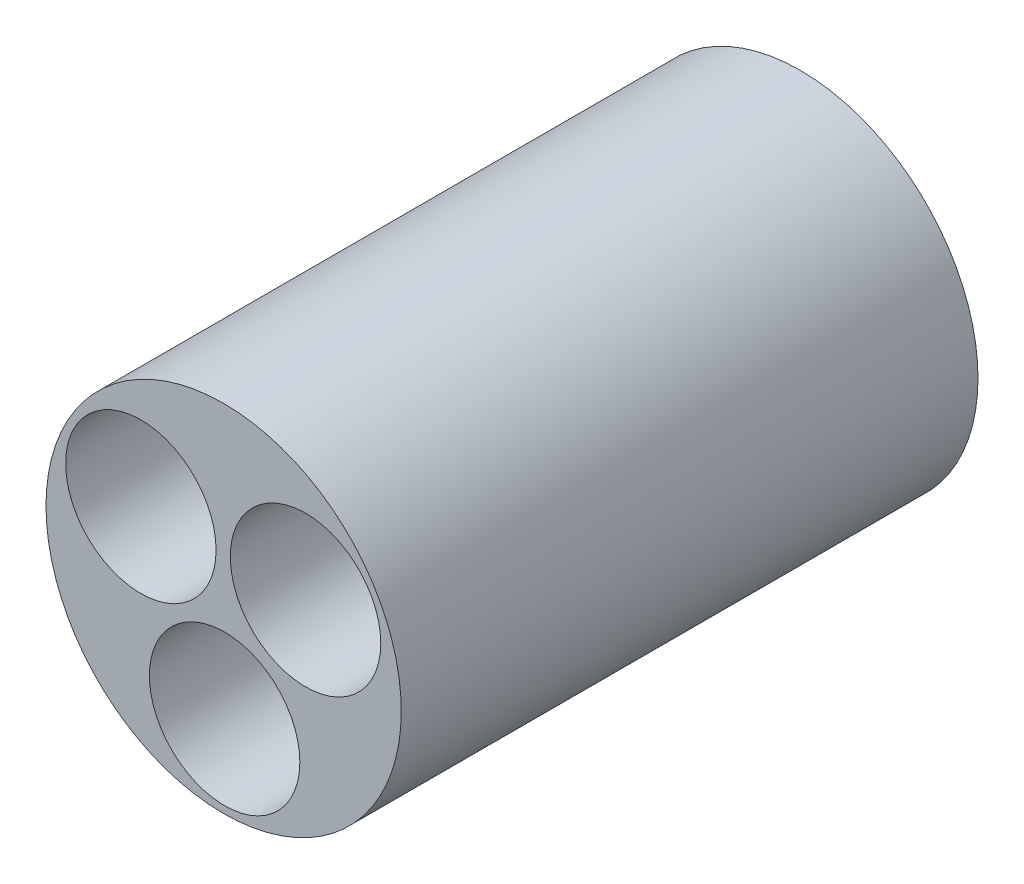
ISO-10303-21;
HEADER;
FILE_DESCRIPTION(('STEP AP214'),'2;1');
FILE_NAME('part.step','',(''),(''),'','','');
FILE_SCHEMA(('AUTOMOTIVE_DESIGN { 1 0 10303 214 1 1 1 1 }'));
ENDSEC;
DATA;
#1=APPLICATION_CONTEXT('core data for automotive mechanical design processes');
#2=APPLICATION_PROTOCOL_DEFINITION('international standard','automotive_design',2000,#1);
#3=PRODUCT_CONTEXT('',#1,'mechanical');
#4=PRODUCT('Part','Part','',(#3));
#5=PRODUCT_RELATED_PRODUCT_CATEGORY('part','',(#4));
#6=PRODUCT_DEFINITION_FORMATION('','',#4);
#7=PRODUCT_DEFINITION_CONTEXT('part definition',#1,'design');
#8=PRODUCT_DEFINITION('design','',#6,#7);
#9=PRODUCT_DEFINITION_SHAPE('','',#8);
#10=(LENGTH_UNIT() NAMED_UNIT(*) SI_UNIT(.MILLI.,.METRE.));
#11=(NAMED_UNIT(*) PLANE_ANGLE_UNIT() SI_UNIT($,.RADIAN.));
#12=(NAMED_UNIT(*) SI_UNIT($,.STERADIAN.) SOLID_ANGLE_UNIT());
#13=UNCERTAINTY_MEASURE_WITH_UNIT(LENGTH_MEASURE(1.E-05),#10,'distance_accuracy_value','');
#14=(GEOMETRIC_REPRESENTATION_CONTEXT(3) GLOBAL_UNCERTAINTY_ASSIGNED_CONTEXT((#13)) GLOBAL_UNIT_ASSIGNED_CONTEXT((#10,
#11,#12)) REPRESENTATION_CONTEXT('',''));
#15=CARTESIAN_POINT('',(0.,0.,0.));
#16=DIRECTION('',(0.,0.,1.));
#17=DIRECTION('',(1.,0.,0.));
#18=AXIS2_PLACEMENT_3D('',#15,#16,#17);
#19=CARTESIAN_POINT('',(0.,0.,70.1));
#20=DIRECTION('',(0.,0.,1.));
#21=DIRECTION('',(1.,0.,0.));
#22=AXIS2_PLACEMENT_3D('',#19,#20,#21);
#23=PLANE('',#22);
#24=CARTESIAN_POINT('',(9.95557947936446,5.86947069419869,70.1));
#25=DIRECTION('',(0.,0.,1.));
#26=DIRECTION('',(1.,0.,0.));
#27=AXIS2_PLACEMENT_3D('',#24,#25,#26);
#28=CIRCLE('',#27,9.144);
#29=CARTESIAN_POINT('',(19.0995794793645,5.86947069419869,70.1));
#30=VERTEX_POINT('',#29);
#31=EDGE_CURVE('E49',#30,#30,#28,.T.);
#32=ORIENTED_EDGE('',*,*,#31,.F.);
#33=EDGE_LOOP('',(#32));
#34=FACE_BOUND('',#33,.T.);
#35=CARTESIAN_POINT('',(0.,0.,70.1));
#36=DIRECTION('',(0.,0.,1.));
#37=DIRECTION('',(1.,0.,0.));
#38=AXIS2_PLACEMENT_3D('',#35,#36,#37);
#39=CIRCLE('',#38,21.59);
#40=CARTESIAN_POINT('',(21.59,0.,70.1));
#41=VERTEX_POINT('',#40);
#42=EDGE_CURVE('E10',#41,#41,#39,.T.);
#43=ORIENTED_EDGE('',*,*,#42,.T.);
#44=EDGE_LOOP('',(#43));
#45=FACE_BOUND('',#44,.T.);
#46=CARTESIAN_POINT('',(0.118855303980422,-11.557,70.1));
#47=DIRECTION('',(0.,0.,1.));
#48=DIRECTION('',(1.,0.,0.));
#49=AXIS2_PLACEMENT_3D('',#46,#47,#48);
#50=CIRCLE('',#49,9.144);
#51=CARTESIAN_POINT('',(9.26285530398042,-11.557,70.1));
#52=VERTEX_POINT('',#51);
#53=EDGE_CURVE('E44',#52,#52,#50,.T.);
#54=ORIENTED_EDGE('',*,*,#53,.F.);
#55=EDGE_LOOP('',(#54));
#56=FACE_BOUND('',#55,.T.);
#57=CARTESIAN_POINT('',(-10.0609004676266,5.68704939142529,70.1));
#58=DIRECTION('',(0.,0.,1.));
#59=DIRECTION('',(1.,0.,0.));
#60=AXIS2_PLACEMENT_3D('',#57,#58,#59);
#61=CIRCLE('',#60,9.144);
#62=CARTESIAN_POINT('',(-0.916900467626609,5.68704939142529,70.1));
#63=VERTEX_POINT('',#62);
#64=EDGE_CURVE('E55',#63,#63,#61,.T.);
#65=ORIENTED_EDGE('',*,*,#64,.F.);
#66=EDGE_LOOP('',(#65));
#67=FACE_BOUND('',#66,.T.);
#68=ADVANCED_FACE('F33',(#34,#45,#56,#67),#23,.T.);
#69=CARTESIAN_POINT('',(0.,0.,0.));
#70=DIRECTION('',(0.,0.,1.));
#71=DIRECTION('',(1.,0.,0.));
#72=AXIS2_PLACEMENT_3D('',#69,#70,#71);
#73=PLANE('',#72);
#74=CARTESIAN_POINT('',(0.,0.,0.));
#75=DIRECTION('',(0.,0.,1.));
#76=DIRECTION('',(1.,0.,0.));
#77=AXIS2_PLACEMENT_3D('',#74,#75,#76);
#78=CIRCLE('',#77,21.59);
#79=CARTESIAN_POINT('',(21.59,0.,0.));
#80=VERTEX_POINT('',#79);
#81=EDGE_CURVE('E37',#80,#80,#78,.T.);
#82=ORIENTED_EDGE('',*,*,#81,.F.);
#83=EDGE_LOOP('',(#82));
#84=FACE_BOUND('',#83,.T.);
#85=CARTESIAN_POINT('',(0.118855303980422,-11.557,0.));
#86=DIRECTION('',(0.,0.,1.));
#87=DIRECTION('',(1.,0.,0.));
#88=AXIS2_PLACEMENT_3D('',#85,#86,#87);
#89=CIRCLE('',#88,9.144);
#90=CARTESIAN_POINT('',(9.26285530398042,-11.557,0.));
#91=VERTEX_POINT('',#90);
#92=EDGE_CURVE('E46',#91,#91,#89,.T.);
#93=ORIENTED_EDGE('',*,*,#92,.T.);
#94=EDGE_LOOP('',(#93));
#95=FACE_BOUND('',#94,.T.);
#96=CARTESIAN_POINT('',(9.95557947936446,5.86947069419869,0.));
#97=DIRECTION('',(0.,0.,1.));
#98=DIRECTION('',(1.,0.,0.));
#99=AXIS2_PLACEMENT_3D('',#96,#97,#98);
#100=CIRCLE('',#99,9.144);
#101=CARTESIAN_POINT('',(19.0995794793645,5.86947069419869,0.));
#102=VERTEX_POINT('',#101);
#103=EDGE_CURVE('E52',#102,#102,#100,.T.);
#104=ORIENTED_EDGE('',*,*,#103,.T.);
#105=EDGE_LOOP('',(#104));
#106=FACE_BOUND('',#105,.T.);
#107=CARTESIAN_POINT('',(-10.0609004676266,5.68704939142529,0.));
#108=DIRECTION('',(0.,0.,1.));
#109=DIRECTION('',(1.,0.,0.));
#110=AXIS2_PLACEMENT_3D('',#107,#108,#109);
#111=CIRCLE('',#110,9.144);
#112=CARTESIAN_POINT('',(-0.916900467626609,5.68704939142529,0.));
#113=VERTEX_POINT('',#112);
#114=EDGE_CURVE('E58',#113,#113,#111,.T.);
#115=ORIENTED_EDGE('',*,*,#114,.T.);
#116=EDGE_LOOP('',(#115));
#117=FACE_BOUND('',#116,.T.);
#118=ADVANCED_FACE('F68',(#84,#95,#106,#117),#73,.F.);
#119=CARTESIAN_POINT('',(0.,0.,70.1));
#120=DIRECTION('',(0.,0.,-1.));
#121=DIRECTION('',(-1.,0.,0.));
#122=AXIS2_PLACEMENT_3D('',#119,#120,#121);
#123=CYLINDRICAL_SURFACE('',#122,21.59);
#124=ORIENTED_EDGE('',*,*,#42,.F.);
#125=EDGE_LOOP('',(#124));
#126=FACE_BOUND('',#125,.T.);
#127=ORIENTED_EDGE('',*,*,#81,.T.);
#128=EDGE_LOOP('',(#127));
#129=FACE_BOUND('',#128,.T.);
#130=ADVANCED_FACE('F35',(#126,#129),#123,.T.);
#131=CARTESIAN_POINT('',(0.118855303980422,-11.557,70.1));
#132=DIRECTION('',(0.,0.,-1.));
#133=DIRECTION('',(-1.,0.,0.));
#134=AXIS2_PLACEMENT_3D('',#131,#132,#133);
#135=CYLINDRICAL_SURFACE('',#134,9.144);
#136=ORIENTED_EDGE('',*,*,#53,.T.);
#137=EDGE_LOOP('',(#136));
#138=FACE_BOUND('',#137,.T.);
#139=ORIENTED_EDGE('',*,*,#92,.F.);
#140=EDGE_LOOP('',(#139));
#141=FACE_BOUND('',#140,.T.);
#142=ADVANCED_FACE('F77',(#138,#141),#135,.F.);
#143=CARTESIAN_POINT('',(9.95557947936446,5.86947069419869,70.1));
#144=DIRECTION('',(0.,0.,-1.));
#145=DIRECTION('',(-1.,0.,0.));
#146=AXIS2_PLACEMENT_3D('',#143,#144,#145);
#147=CYLINDRICAL_SURFACE('',#146,9.144);
#148=ORIENTED_EDGE('',*,*,#31,.T.);
#149=EDGE_LOOP('',(#148));
#150=FACE_BOUND('',#149,.T.);
#151=ORIENTED_EDGE('',*,*,#103,.F.);
#152=EDGE_LOOP('',(#151));
#153=FACE_BOUND('',#152,.T.);
#154=ADVANCED_FACE('F80',(#150,#153),#147,.F.);
#155=CARTESIAN_POINT('',(-10.0609004676266,5.68704939142529,70.1));
#156=DIRECTION('',(0.,0.,-1.));
#157=DIRECTION('',(-1.,0.,0.));
#158=AXIS2_PLACEMENT_3D('',#155,#156,#157);
#159=CYLINDRICAL_SURFACE('',#158,9.144);
#160=ORIENTED_EDGE('',*,*,#64,.T.);
#161=EDGE_LOOP('',(#160));
#162=FACE_BOUND('',#161,.T.);
#163=ORIENTED_EDGE('',*,*,#114,.F.);
#164=EDGE_LOOP('',(#163));
#165=FACE_BOUND('',#164,.T.);
#166=ADVANCED_FACE('F64',(#162,#165),#159,.F.);
#167=CLOSED_SHELL('',(#68,#118,#130,#142,#154,#166));
#168=MANIFOLD_SOLID_BREP('B2',#167);
#169=ADVANCED_BREP_SHAPE_REPRESENTATION('',(#18,#168),#14);
#170=SHAPE_DEFINITION_REPRESENTATION(#9,#169);
ENDSEC;
END-ISO-10303-21;
